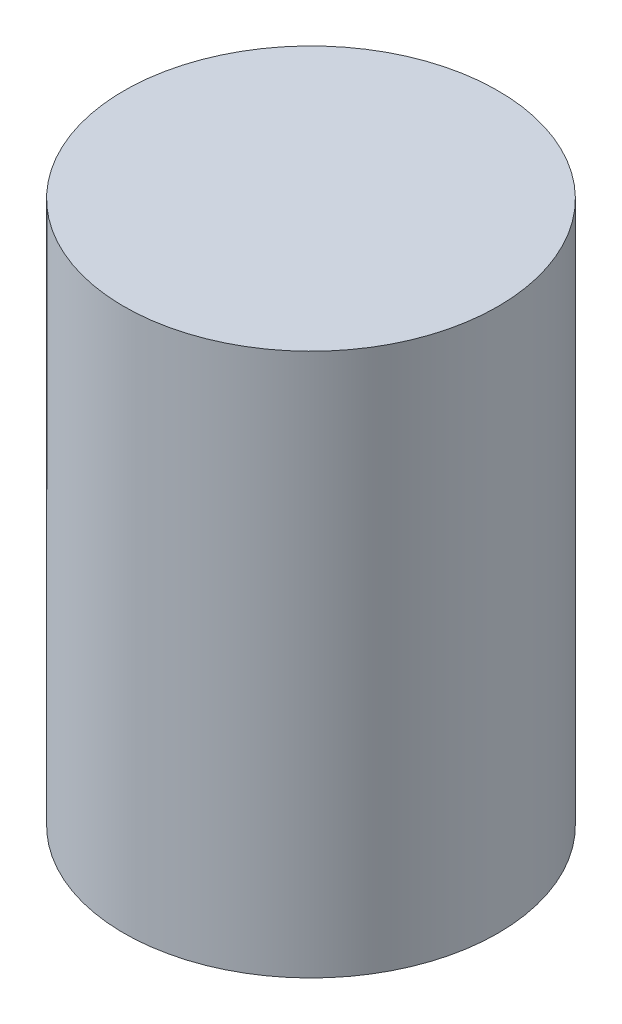
ISO-10303-21;
HEADER;
FILE_DESCRIPTION(('STEP AP214'),'2;1');
FILE_NAME('part.step','',(''),(''),'','','');
FILE_SCHEMA(('AUTOMOTIVE_DESIGN { 1 0 10303 214 1 1 1 1 }'));
ENDSEC;
DATA;
#1=APPLICATION_CONTEXT('core data for automotive mechanical design processes');
#2=APPLICATION_PROTOCOL_DEFINITION('international standard','automotive_design',2000,#1);
#3=PRODUCT_CONTEXT('',#1,'mechanical');
#4=PRODUCT('Part','Part','',(#3));
#5=PRODUCT_RELATED_PRODUCT_CATEGORY('part','',(#4));
#6=PRODUCT_DEFINITION_FORMATION('','',#4);
#7=PRODUCT_DEFINITION_CONTEXT('part definition',#1,'design');
#8=PRODUCT_DEFINITION('design','',#6,#7);
#9=PRODUCT_DEFINITION_SHAPE('','',#8);
#10=(LENGTH_UNIT() NAMED_UNIT(*) SI_UNIT(.MILLI.,.METRE.));
#11=(NAMED_UNIT(*) PLANE_ANGLE_UNIT() SI_UNIT($,.RADIAN.));
#12=(NAMED_UNIT(*) SI_UNIT($,.STERADIAN.) SOLID_ANGLE_UNIT());
#13=UNCERTAINTY_MEASURE_WITH_UNIT(LENGTH_MEASURE(1.E-05),#10,'distance_accuracy_value','');
#14=(GEOMETRIC_REPRESENTATION_CONTEXT(3) GLOBAL_UNCERTAINTY_ASSIGNED_CONTEXT((#13)) GLOBAL_UNIT_ASSIGNED_CONTEXT((#10,
#11,#12)) REPRESENTATION_CONTEXT('',''));
#15=CARTESIAN_POINT('',(0.,0.,0.));
#16=DIRECTION('',(0.,0.,1.));
#17=DIRECTION('',(1.,0.,0.));
#18=AXIS2_PLACEMENT_3D('',#15,#16,#17);
#19=CARTESIAN_POINT('',(0.,0.,0.));
#20=DIRECTION('',(0.,-1.,0.));
#21=DIRECTION('',(1.,0.,0.));
#22=AXIS2_PLACEMENT_3D('',#19,#20,#21);
#23=PLANE('',#22);
#24=CARTESIAN_POINT('',(0.,0.,0.));
#25=DIRECTION('',(0.,-1.,0.));
#26=DIRECTION('',(1.,0.,0.));
#27=AXIS2_PLACEMENT_3D('',#24,#25,#26);
#28=CIRCLE('',#27,35.);
#29=CARTESIAN_POINT('',(35.,0.,0.));
#30=VERTEX_POINT('',#29);
#31=EDGE_CURVE('E10',#30,#30,#28,.T.);
#32=ORIENTED_EDGE('',*,*,#31,.T.);
#33=EDGE_LOOP('',(#32));
#34=FACE_BOUND('',#33,.T.);
#35=ADVANCED_FACE('F33',(#34),#23,.T.);
#36=CARTESIAN_POINT('',(0.,-32.0200163960749,0.));
#37=DIRECTION('',(0.,-1.,0.));
#38=DIRECTION('',(1.,0.,0.));
#39=AXIS2_PLACEMENT_3D('',#36,#37,#38);
#40=CYLINDRICAL_SURFACE('',#39,35.);
#41=CARTESIAN_POINT('',(0.,101.6,0.));
#42=DIRECTION('',(0.,-1.,0.));
#43=DIRECTION('',(1.,0.,0.));
#44=AXIS2_PLACEMENT_3D('',#41,#42,#43);
#45=CIRCLE('',#44,35.);
#46=CARTESIAN_POINT('',(35.,101.6,0.));
#47=VERTEX_POINT('',#46);
#48=EDGE_CURVE('E40',#47,#47,#45,.T.);
#49=ORIENTED_EDGE('',*,*,#48,.T.);
#50=EDGE_LOOP('',(#49));
#51=FACE_BOUND('',#50,.T.);
#52=ORIENTED_EDGE('',*,*,#31,.F.);
#53=EDGE_LOOP('',(#52));
#54=FACE_BOUND('',#53,.T.);
#55=ADVANCED_FACE('F74',(#51,#54),#40,.T.);
#56=CARTESIAN_POINT('',(0.,101.6,0.));
#57=DIRECTION('',(0.,1.,0.));
#58=DIRECTION('',(-1.,0.,0.));
#59=AXIS2_PLACEMENT_3D('',#56,#57,#58);
#60=PLANE('',#59);
#61=ORIENTED_EDGE('',*,*,#48,.F.);
#62=EDGE_LOOP('',(#61));
#63=FACE_BOUND('',#62,.T.);
#64=ADVANCED_FACE('F73',(#63),#60,.T.);
#65=CLOSED_SHELL('',(#35,#55,#64));
#66=CARTESIAN_POINT('',(0.,91.6,0.));
#67=DIRECTION('',(0.,1.,0.));
#68=DIRECTION('',(-1.,0.,0.));
#69=AXIS2_PLACEMENT_3D('',#66,#67,#68);
#70=PLANE('',#69);
#71=CARTESIAN_POINT('',(0.,91.6,0.));
#72=DIRECTION('',(0.,-1.,0.));
#73=DIRECTION('',(1.,0.,0.));
#74=AXIS2_PLACEMENT_3D('',#71,#72,#73);
#75=CIRCLE('',#74,25.);
#76=CARTESIAN_POINT('',(25.,91.6,0.));
#77=VERTEX_POINT('',#76);
#78=EDGE_CURVE('E44',#77,#77,#75,.T.);
#79=ORIENTED_EDGE('',*,*,#78,.T.);
#80=EDGE_LOOP('',(#79));
#81=FACE_BOUND('',#80,.T.);
#82=ADVANCED_FACE('F63',(#81),#70,.F.);
#83=CARTESIAN_POINT('',(0.,-32.0200163960749,0.));
#84=DIRECTION('',(0.,-1.,0.));
#85=DIRECTION('',(1.,0.,0.));
#86=AXIS2_PLACEMENT_3D('',#83,#84,#85);
#87=CYLINDRICAL_SURFACE('',#86,25.);
#88=ORIENTED_EDGE('',*,*,#78,.F.);
#89=EDGE_LOOP('',(#88));
#90=FACE_BOUND('',#89,.T.);
#91=CARTESIAN_POINT('',(0.,20.,0.));
#92=DIRECTION('',(0.,-1.,0.));
#93=DIRECTION('',(1.,0.,0.));
#94=AXIS2_PLACEMENT_3D('',#91,#92,#93);
#95=CIRCLE('',#94,25.);
#96=CARTESIAN_POINT('',(25.,20.,0.));
#97=VERTEX_POINT('',#96);
#98=EDGE_CURVE('E48',#97,#97,#95,.T.);
#99=ORIENTED_EDGE('',*,*,#98,.T.);
#100=EDGE_LOOP('',(#99));
#101=FACE_BOUND('',#100,.T.);
#102=ADVANCED_FACE('F54',(#90,#101),#87,.F.);
#103=CARTESIAN_POINT('',(0.,20.,0.));
#104=DIRECTION('',(0.,-1.,0.));
#105=DIRECTION('',(1.,0.,0.));
#106=AXIS2_PLACEMENT_3D('',#103,#104,#105);
#107=PLANE('',#106);
#108=ORIENTED_EDGE('',*,*,#98,.F.);
#109=EDGE_LOOP('',(#108));
#110=FACE_BOUND('',#109,.T.);
#111=ADVANCED_FACE('F56',(#110),#107,.F.);
#112=CLOSED_SHELL('',(#82,#102,#111));
#113=ORIENTED_CLOSED_SHELL('',*,#112,.T.);
#114=BREP_WITH_VOIDS('B2',#65,(#113));
#115=ADVANCED_BREP_SHAPE_REPRESENTATION('',(#18,#114),#14);
#116=SHAPE_DEFINITION_REPRESENTATION(#9,#115);
ENDSEC;
END-ISO-10303-21;
